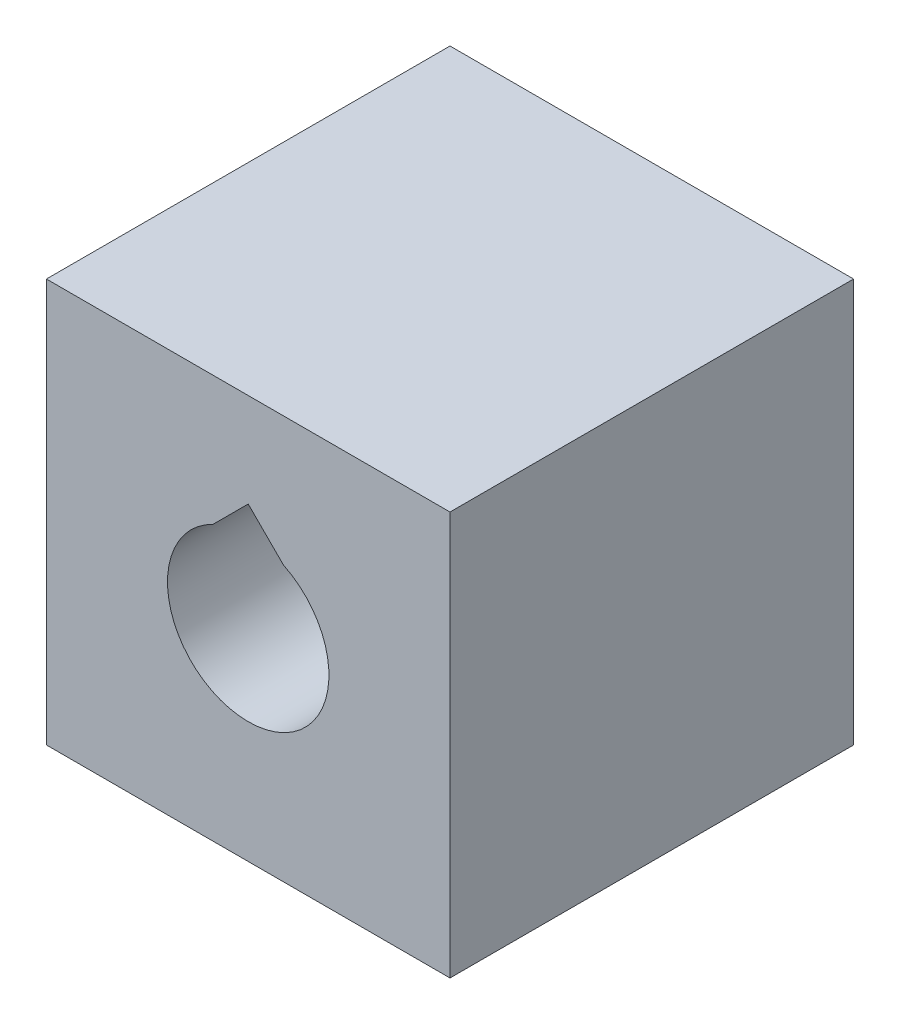
ISO-10303-21;
HEADER;
FILE_DESCRIPTION(('STEP AP214'),'2;1');
FILE_NAME('part.step','',(''),(''),'','','');
FILE_SCHEMA(('AUTOMOTIVE_DESIGN { 1 0 10303 214 1 1 1 1 }'));
ENDSEC;
DATA;
#1=APPLICATION_CONTEXT('core data for automotive mechanical design processes');
#2=APPLICATION_PROTOCOL_DEFINITION('international standard','automotive_design',2000,#1);
#3=PRODUCT_CONTEXT('',#1,'mechanical');
#4=PRODUCT('Part','Part','',(#3));
#5=PRODUCT_RELATED_PRODUCT_CATEGORY('part','',(#4));
#6=PRODUCT_DEFINITION_FORMATION('','',#4);
#7=PRODUCT_DEFINITION_CONTEXT('part definition',#1,'design');
#8=PRODUCT_DEFINITION('design','',#6,#7);
#9=PRODUCT_DEFINITION_SHAPE('','',#8);
#10=(LENGTH_UNIT() NAMED_UNIT(*) SI_UNIT(.MILLI.,.METRE.));
#11=(NAMED_UNIT(*) PLANE_ANGLE_UNIT() SI_UNIT($,.RADIAN.));
#12=(NAMED_UNIT(*) SI_UNIT($,.STERADIAN.) SOLID_ANGLE_UNIT());
#13=UNCERTAINTY_MEASURE_WITH_UNIT(LENGTH_MEASURE(1.E-05),#10,'distance_accuracy_value','');
#14=(GEOMETRIC_REPRESENTATION_CONTEXT(3) GLOBAL_UNCERTAINTY_ASSIGNED_CONTEXT((#13)) GLOBAL_UNIT_ASSIGNED_CONTEXT((#10,
#11,#12)) REPRESENTATION_CONTEXT('',''));
#15=CARTESIAN_POINT('',(0.,0.,0.));
#16=DIRECTION('',(0.,0.,1.));
#17=DIRECTION('',(1.,0.,0.));
#18=AXIS2_PLACEMENT_3D('',#15,#16,#17);
#19=CARTESIAN_POINT('',(-12.5,25.,12.5));
#20=DIRECTION('',(1.,0.,0.));
#21=DIRECTION('',(0.,0.,-1.));
#22=AXIS2_PLACEMENT_3D('',#19,#20,#21);
#23=PLANE('',#22);
#24=DIRECTION('',(0.,0.,1.));
#25=VECTOR('',#24,1.);
#26=CARTESIAN_POINT('',(-12.5,0.,12.5));
#27=LINE('',#26,#25);
#28=CARTESIAN_POINT('',(-12.5,0.,-12.5));
#29=VERTEX_POINT('',#28);
#30=CARTESIAN_POINT('',(-12.5,0.,12.5));
#31=VERTEX_POINT('',#30);
#32=EDGE_CURVE('E117',#29,#31,#27,.T.);
#33=ORIENTED_EDGE('',*,*,#32,.T.);
#34=DIRECTION('',(0.,-1.,0.));
#35=VECTOR('',#34,1.);
#36=CARTESIAN_POINT('',(-12.5,25.,12.5));
#37=LINE('',#36,#35);
#38=CARTESIAN_POINT('',(-12.5,25.,12.5));
#39=VERTEX_POINT('',#38);
#40=EDGE_CURVE('E11',#39,#31,#37,.T.);
#41=ORIENTED_EDGE('',*,*,#40,.F.);
#42=DIRECTION('',(0.,0.,1.));
#43=VECTOR('',#42,1.);
#44=CARTESIAN_POINT('',(-12.5,25.,12.5));
#45=LINE('',#44,#43);
#46=CARTESIAN_POINT('',(-12.5,25.,-12.5));
#47=VERTEX_POINT('',#46);
#48=EDGE_CURVE('E119',#47,#39,#45,.T.);
#49=ORIENTED_EDGE('',*,*,#48,.F.);
#50=DIRECTION('',(0.,-1.,0.));
#51=VECTOR('',#50,1.);
#52=CARTESIAN_POINT('',(-12.5,25.,-12.5));
#53=LINE('',#52,#51);
#54=EDGE_CURVE('E129',#47,#29,#53,.T.);
#55=ORIENTED_EDGE('',*,*,#54,.T.);
#56=EDGE_LOOP('',(#33,#41,#49,#55));
#57=FACE_BOUND('',#56,.T.);
#58=ADVANCED_FACE('F33',(#57),#23,.F.);
#59=CARTESIAN_POINT('',(12.5,25.,12.5));
#60=DIRECTION('',(0.,0.,-1.));
#61=DIRECTION('',(-1.,0.,0.));
#62=AXIS2_PLACEMENT_3D('',#59,#60,#61);
#63=PLANE('',#62);
#64=DIRECTION('',(-0.707106781186546,0.707106781186549,0.));
#65=VECTOR('',#64,1.);
#66=CARTESIAN_POINT('',(2.17944947177034,17.,12.5));
#67=LINE('',#66,#65);
#68=CARTESIAN_POINT('',(2.17944947177034,17.,12.5));
#69=VERTEX_POINT('',#68);
#70=CARTESIAN_POINT('',(0.,19.1794494717704,12.5));
#71=VERTEX_POINT('',#70);
#72=EDGE_CURVE('E109',#69,#71,#67,.T.);
#73=ORIENTED_EDGE('',*,*,#72,.F.);
#74=CARTESIAN_POINT('',(0.,12.5,12.5));
#75=DIRECTION('',(0.,0.,1.));
#76=DIRECTION('',(1.,0.,0.));
#77=AXIS2_PLACEMENT_3D('',#74,#75,#76);
#78=CIRCLE('',#77,5.);
#79=CARTESIAN_POINT('',(-2.17944947177034,17.,12.5));
#80=VERTEX_POINT('',#79);
#81=EDGE_CURVE('E47',#80,#69,#78,.T.);
#82=ORIENTED_EDGE('',*,*,#81,.F.);
#83=DIRECTION('',(-0.707106781186546,-0.707106781186549,0.));
#84=VECTOR('',#83,1.);
#85=CARTESIAN_POINT('',(-2.17944947177034,17.,12.5));
#86=LINE('',#85,#84);
#87=EDGE_CURVE('E106',#71,#80,#86,.T.);
#88=ORIENTED_EDGE('',*,*,#87,.F.);
#89=EDGE_LOOP('',(#73,#82,#88));
#90=FACE_BOUND('',#89,.T.);
#91=DIRECTION('',(1.,0.,0.));
#92=VECTOR('',#91,1.);
#93=CARTESIAN_POINT('',(12.5,0.,12.5));
#94=LINE('',#93,#92);
#95=CARTESIAN_POINT('',(12.5,0.,12.5));
#96=VERTEX_POINT('',#95);
#97=EDGE_CURVE('E132',#31,#96,#94,.T.);
#98=ORIENTED_EDGE('',*,*,#97,.T.);
#99=DIRECTION('',(0.,-1.,0.));
#100=VECTOR('',#99,1.);
#101=CARTESIAN_POINT('',(12.5,25.,12.5));
#102=LINE('',#101,#100);
#103=CARTESIAN_POINT('',(12.5,25.,12.5));
#104=VERTEX_POINT('',#103);
#105=EDGE_CURVE('E40',#104,#96,#102,.T.);
#106=ORIENTED_EDGE('',*,*,#105,.F.);
#107=DIRECTION('',(1.,0.,0.));
#108=VECTOR('',#107,1.);
#109=CARTESIAN_POINT('',(12.5,25.,12.5));
#110=LINE('',#109,#108);
#111=EDGE_CURVE('E122',#39,#104,#110,.T.);
#112=ORIENTED_EDGE('',*,*,#111,.F.);
#113=ORIENTED_EDGE('',*,*,#40,.T.);
#114=EDGE_LOOP('',(#98,#106,#112,#113));
#115=FACE_BOUND('',#114,.T.);
#116=ADVANCED_FACE('F160',(#90,#115),#63,.F.);
#117=CARTESIAN_POINT('',(12.5,25.,12.5));
#118=DIRECTION('',(-1.,0.,0.));
#119=DIRECTION('',(0.,0.,1.));
#120=AXIS2_PLACEMENT_3D('',#117,#118,#119);
#121=PLANE('',#120);
#122=DIRECTION('',(0.,0.,-1.));
#123=VECTOR('',#122,1.);
#124=CARTESIAN_POINT('',(12.5,0.,12.5));
#125=LINE('',#124,#123);
#126=CARTESIAN_POINT('',(12.5,0.,-12.5));
#127=VERTEX_POINT('',#126);
#128=EDGE_CURVE('E134',#96,#127,#125,.T.);
#129=ORIENTED_EDGE('',*,*,#128,.T.);
#130=DIRECTION('',(0.,-1.,0.));
#131=VECTOR('',#130,1.);
#132=CARTESIAN_POINT('',(12.5,25.,-12.5));
#133=LINE('',#132,#131);
#134=CARTESIAN_POINT('',(12.5,25.,-12.5));
#135=VERTEX_POINT('',#134);
#136=EDGE_CURVE('E139',#135,#127,#133,.T.);
#137=ORIENTED_EDGE('',*,*,#136,.F.);
#138=DIRECTION('',(0.,0.,-1.));
#139=VECTOR('',#138,1.);
#140=CARTESIAN_POINT('',(12.5,25.,12.5));
#141=LINE('',#140,#139);
#142=EDGE_CURVE('E125',#104,#135,#141,.T.);
#143=ORIENTED_EDGE('',*,*,#142,.F.);
#144=ORIENTED_EDGE('',*,*,#105,.T.);
#145=EDGE_LOOP('',(#129,#137,#143,#144));
#146=FACE_BOUND('',#145,.T.);
#147=ADVANCED_FACE('F146',(#146),#121,.F.);
#148=CARTESIAN_POINT('',(12.5,25.,-12.5));
#149=DIRECTION('',(0.,0.,1.));
#150=DIRECTION('',(1.,0.,0.));
#151=AXIS2_PLACEMENT_3D('',#148,#149,#150);
#152=PLANE('',#151);
#153=DIRECTION('',(-0.707106781186546,-0.707106781186549,0.));
#154=VECTOR('',#153,1.);
#155=CARTESIAN_POINT('',(-2.17944947177034,17.,-12.5));
#156=LINE('',#155,#154);
#157=CARTESIAN_POINT('',(0.,19.1794494717704,-12.5));
#158=VERTEX_POINT('',#157);
#159=CARTESIAN_POINT('',(-2.17944947177034,17.,-12.5));
#160=VERTEX_POINT('',#159);
#161=EDGE_CURVE('E55',#158,#160,#156,.T.);
#162=ORIENTED_EDGE('',*,*,#161,.T.);
#163=CARTESIAN_POINT('',(0.,12.5,-12.5));
#164=DIRECTION('',(0.,0.,1.));
#165=DIRECTION('',(1.,0.,0.));
#166=AXIS2_PLACEMENT_3D('',#163,#164,#165);
#167=CIRCLE('',#166,5.);
#168=CARTESIAN_POINT('',(2.17944947177034,17.,-12.5));
#169=VERTEX_POINT('',#168);
#170=EDGE_CURVE('E93',#160,#169,#167,.T.);
#171=ORIENTED_EDGE('',*,*,#170,.T.);
#172=DIRECTION('',(-0.707106781186546,0.707106781186549,0.));
#173=VECTOR('',#172,1.);
#174=CARTESIAN_POINT('',(2.17944947177034,17.,-12.5));
#175=LINE('',#174,#173);
#176=EDGE_CURVE('E100',#169,#158,#175,.T.);
#177=ORIENTED_EDGE('',*,*,#176,.T.);
#178=EDGE_LOOP('',(#162,#171,#177));
#179=FACE_BOUND('',#178,.T.);
#180=DIRECTION('',(-1.,0.,0.));
#181=VECTOR('',#180,1.);
#182=CARTESIAN_POINT('',(12.5,0.,-12.5));
#183=LINE('',#182,#181);
#184=EDGE_CURVE('E123',#127,#29,#183,.T.);
#185=ORIENTED_EDGE('',*,*,#184,.T.);
#186=ORIENTED_EDGE('',*,*,#54,.F.);
#187=DIRECTION('',(-1.,0.,0.));
#188=VECTOR('',#187,1.);
#189=CARTESIAN_POINT('',(12.5,25.,-12.5));
#190=LINE('',#189,#188);
#191=EDGE_CURVE('E127',#135,#47,#190,.T.);
#192=ORIENTED_EDGE('',*,*,#191,.F.);
#193=ORIENTED_EDGE('',*,*,#136,.T.);
#194=EDGE_LOOP('',(#185,#186,#192,#193));
#195=FACE_BOUND('',#194,.T.);
#196=ADVANCED_FACE('F104',(#179,#195),#152,.F.);
#197=CARTESIAN_POINT('',(0.,25.,0.));
#198=DIRECTION('',(0.,1.,0.));
#199=DIRECTION('',(0.,0.,1.));
#200=AXIS2_PLACEMENT_3D('',#197,#198,#199);
#201=PLANE('',#200);
#202=ORIENTED_EDGE('',*,*,#48,.T.);
#203=ORIENTED_EDGE('',*,*,#111,.T.);
#204=ORIENTED_EDGE('',*,*,#142,.T.);
#205=ORIENTED_EDGE('',*,*,#191,.T.);
#206=EDGE_LOOP('',(#202,#203,#204,#205));
#207=FACE_BOUND('',#206,.T.);
#208=ADVANCED_FACE('F159',(#207),#201,.T.);
#209=CARTESIAN_POINT('',(0.,0.,0.));
#210=DIRECTION('',(0.,1.,0.));
#211=DIRECTION('',(0.,0.,1.));
#212=AXIS2_PLACEMENT_3D('',#209,#210,#211);
#213=PLANE('',#212);
#214=ORIENTED_EDGE('',*,*,#32,.F.);
#215=ORIENTED_EDGE('',*,*,#184,.F.);
#216=ORIENTED_EDGE('',*,*,#128,.F.);
#217=ORIENTED_EDGE('',*,*,#97,.F.);
#218=EDGE_LOOP('',(#214,#215,#216,#217));
#219=FACE_BOUND('',#218,.T.);
#220=ADVANCED_FACE('F152',(#219),#213,.F.);
#221=CARTESIAN_POINT('',(0.,12.5,-12.5));
#222=DIRECTION('',(0.,0.,1.));
#223=DIRECTION('',(1.,0.,0.));
#224=AXIS2_PLACEMENT_3D('',#221,#222,#223);
#225=CYLINDRICAL_SURFACE('',#224,5.);
#226=ORIENTED_EDGE('',*,*,#81,.T.);
#227=DIRECTION('',(0.,0.,1.));
#228=VECTOR('',#227,1.);
#229=CARTESIAN_POINT('',(2.17944947177034,17.,-12.5));
#230=LINE('',#229,#228);
#231=EDGE_CURVE('E89',#169,#69,#230,.T.);
#232=ORIENTED_EDGE('',*,*,#231,.F.);
#233=ORIENTED_EDGE('',*,*,#170,.F.);
#234=DIRECTION('',(0.,0.,1.));
#235=VECTOR('',#234,1.);
#236=CARTESIAN_POINT('',(-2.17944947177034,17.,-12.5));
#237=LINE('',#236,#235);
#238=EDGE_CURVE('E115',#160,#80,#237,.T.);
#239=ORIENTED_EDGE('',*,*,#238,.T.);
#240=EDGE_LOOP('',(#226,#232,#233,#239));
#241=FACE_BOUND('',#240,.T.);
#242=ADVANCED_FACE('F91',(#241),#225,.F.);
#243=CARTESIAN_POINT('',(-2.17944947177034,17.,-12.5));
#244=DIRECTION('',(-0.707106781186549,0.707106781186546,0.));
#245=DIRECTION('',(-0.707106781186546,-0.707106781186549,0.));
#246=AXIS2_PLACEMENT_3D('',#243,#244,#245);
#247=PLANE('',#246);
#248=ORIENTED_EDGE('',*,*,#87,.T.);
#249=ORIENTED_EDGE('',*,*,#238,.F.);
#250=ORIENTED_EDGE('',*,*,#161,.F.);
#251=DIRECTION('',(0.,0.,1.));
#252=VECTOR('',#251,1.);
#253=CARTESIAN_POINT('',(0.,19.1794494717704,-12.5));
#254=LINE('',#253,#252);
#255=EDGE_CURVE('E97',#158,#71,#254,.T.);
#256=ORIENTED_EDGE('',*,*,#255,.T.);
#257=EDGE_LOOP('',(#248,#249,#250,#256));
#258=FACE_BOUND('',#257,.T.);
#259=ADVANCED_FACE('F177',(#258),#247,.F.);
#260=CARTESIAN_POINT('',(2.17944947177034,17.,-12.5));
#261=DIRECTION('',(0.707106781186549,0.707106781186546,0.));
#262=DIRECTION('',(-0.707106781186546,0.707106781186549,0.));
#263=AXIS2_PLACEMENT_3D('',#260,#261,#262);
#264=PLANE('',#263);
#265=ORIENTED_EDGE('',*,*,#72,.T.);
#266=ORIENTED_EDGE('',*,*,#255,.F.);
#267=ORIENTED_EDGE('',*,*,#176,.F.);
#268=ORIENTED_EDGE('',*,*,#231,.T.);
#269=EDGE_LOOP('',(#265,#266,#267,#268));
#270=FACE_BOUND('',#269,.T.);
#271=ADVANCED_FACE('F101',(#270),#264,.F.);
#272=CLOSED_SHELL('',(#58,#116,#147,#196,#208,#220,#242,#259,#271));
#273=MANIFOLD_SOLID_BREP('B2',#272);
#274=ADVANCED_BREP_SHAPE_REPRESENTATION('',(#18,#273),#14);
#275=SHAPE_DEFINITION_REPRESENTATION(#9,#274);
ENDSEC;
END-ISO-10303-21;
